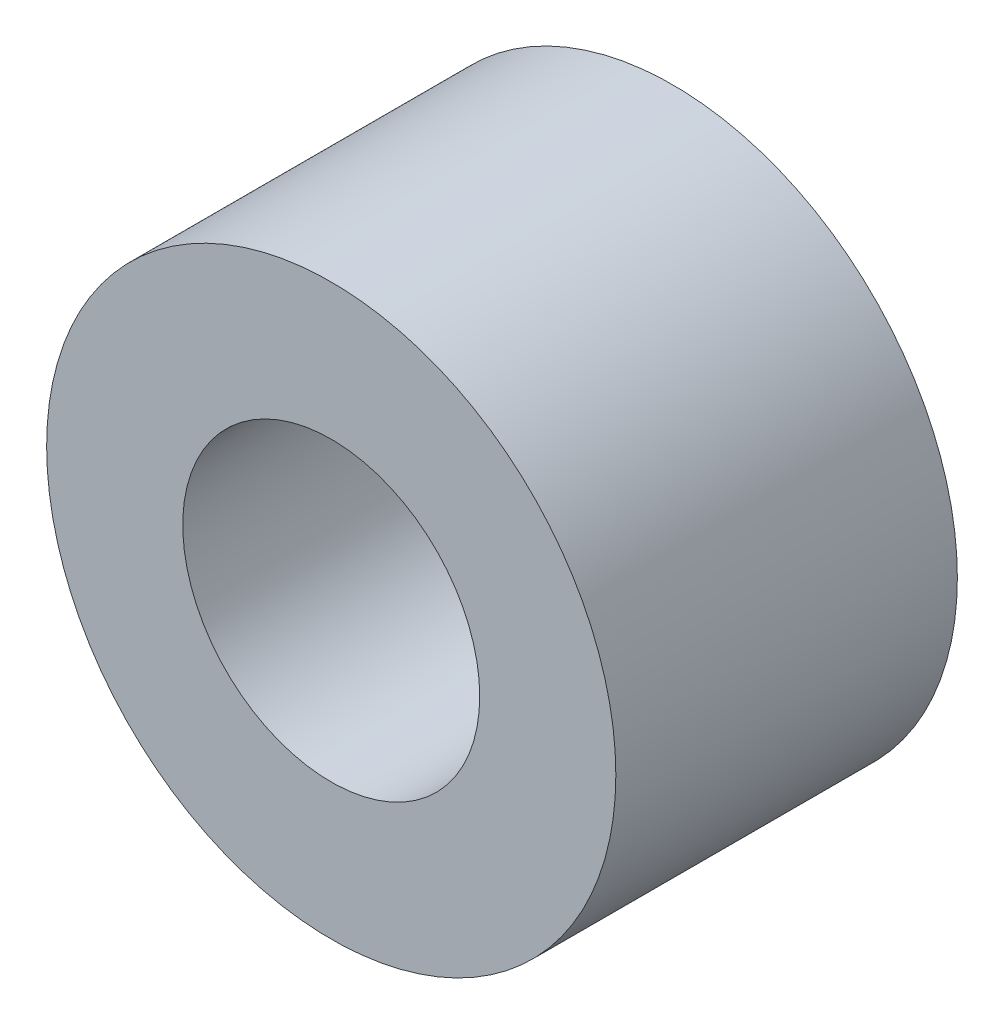
ISO-10303-21;
HEADER;
FILE_DESCRIPTION(('STEP AP214'),'2;1');
FILE_NAME('part.step','',(''),(''),'','','');
FILE_SCHEMA(('AUTOMOTIVE_DESIGN { 1 0 10303 214 1 1 1 1 }'));
ENDSEC;
DATA;
#1=APPLICATION_CONTEXT('core data for automotive mechanical design processes');
#2=APPLICATION_PROTOCOL_DEFINITION('international standard','automotive_design',2000,#1);
#3=PRODUCT_CONTEXT('',#1,'mechanical');
#4=PRODUCT('Part','Part','',(#3));
#5=PRODUCT_RELATED_PRODUCT_CATEGORY('part','',(#4));
#6=PRODUCT_DEFINITION_FORMATION('','',#4);
#7=PRODUCT_DEFINITION_CONTEXT('part definition',#1,'design');
#8=PRODUCT_DEFINITION('design','',#6,#7);
#9=PRODUCT_DEFINITION_SHAPE('','',#8);
#10=(LENGTH_UNIT() NAMED_UNIT(*) SI_UNIT(.MILLI.,.METRE.));
#11=(NAMED_UNIT(*) PLANE_ANGLE_UNIT() SI_UNIT($,.RADIAN.));
#12=(NAMED_UNIT(*) SI_UNIT($,.STERADIAN.) SOLID_ANGLE_UNIT());
#13=UNCERTAINTY_MEASURE_WITH_UNIT(LENGTH_MEASURE(1.E-05),#10,'distance_accuracy_value','');
#14=(GEOMETRIC_REPRESENTATION_CONTEXT(3) GLOBAL_UNCERTAINTY_ASSIGNED_CONTEXT((#13)) GLOBAL_UNIT_ASSIGNED_CONTEXT((#10,
#11,#12)) REPRESENTATION_CONTEXT('',''));
#15=CARTESIAN_POINT('',(0.,0.,0.));
#16=DIRECTION('',(0.,0.,1.));
#17=DIRECTION('',(1.,0.,0.));
#18=AXIS2_PLACEMENT_3D('',#15,#16,#17);
#19=CARTESIAN_POINT('',(0.,0.,13.8));
#20=DIRECTION('',(0.,0.,1.));
#21=DIRECTION('',(1.,0.,0.));
#22=AXIS2_PLACEMENT_3D('',#19,#20,#21);
#23=PLANE('',#22);
#24=CARTESIAN_POINT('',(0.,0.,13.8));
#25=DIRECTION('',(0.,0.,1.));
#26=DIRECTION('',(1.,0.,0.));
#27=AXIS2_PLACEMENT_3D('',#24,#25,#26);
#28=CIRCLE('',#27,11.5);
#29=CARTESIAN_POINT('',(11.5,0.,13.8));
#30=VERTEX_POINT('',#29);
#31=EDGE_CURVE('E10',#30,#30,#28,.T.);
#32=ORIENTED_EDGE('',*,*,#31,.T.);
#33=EDGE_LOOP('',(#32));
#34=FACE_BOUND('',#33,.T.);
#35=CARTESIAN_POINT('',(0.,0.,13.8));
#36=DIRECTION('',(0.,0.,1.));
#37=DIRECTION('',(1.,0.,0.));
#38=AXIS2_PLACEMENT_3D('',#35,#36,#37);
#39=CIRCLE('',#38,6.);
#40=CARTESIAN_POINT('',(6.,0.,13.8));
#41=VERTEX_POINT('',#40);
#42=EDGE_CURVE('E42',#41,#41,#39,.T.);
#43=ORIENTED_EDGE('',*,*,#42,.F.);
#44=EDGE_LOOP('',(#43));
#45=FACE_BOUND('',#44,.T.);
#46=ADVANCED_FACE('F31',(#34,#45),#23,.T.);
#47=CARTESIAN_POINT('',(0.,0.,0.));
#48=DIRECTION('',(0.,0.,1.));
#49=DIRECTION('',(1.,0.,0.));
#50=AXIS2_PLACEMENT_3D('',#47,#48,#49);
#51=PLANE('',#50);
#52=CARTESIAN_POINT('',(0.,0.,0.));
#53=DIRECTION('',(0.,0.,1.));
#54=DIRECTION('',(1.,0.,0.));
#55=AXIS2_PLACEMENT_3D('',#52,#53,#54);
#56=CIRCLE('',#55,11.5);
#57=CARTESIAN_POINT('',(11.5,0.,0.));
#58=VERTEX_POINT('',#57);
#59=EDGE_CURVE('E35',#58,#58,#56,.T.);
#60=ORIENTED_EDGE('',*,*,#59,.F.);
#61=EDGE_LOOP('',(#60));
#62=FACE_BOUND('',#61,.T.);
#63=CARTESIAN_POINT('',(0.,0.,0.));
#64=DIRECTION('',(0.,0.,1.));
#65=DIRECTION('',(1.,0.,0.));
#66=AXIS2_PLACEMENT_3D('',#63,#64,#65);
#67=CIRCLE('',#66,6.);
#68=CARTESIAN_POINT('',(6.,0.,0.));
#69=VERTEX_POINT('',#68);
#70=EDGE_CURVE('E44',#69,#69,#67,.T.);
#71=ORIENTED_EDGE('',*,*,#70,.T.);
#72=EDGE_LOOP('',(#71));
#73=FACE_BOUND('',#72,.T.);
#74=ADVANCED_FACE('F54',(#62,#73),#51,.F.);
#75=CARTESIAN_POINT('',(0.,0.,13.8));
#76=DIRECTION('',(0.,0.,-1.));
#77=DIRECTION('',(-1.,0.,0.));
#78=AXIS2_PLACEMENT_3D('',#75,#76,#77);
#79=CYLINDRICAL_SURFACE('',#78,11.5);
#80=ORIENTED_EDGE('',*,*,#31,.F.);
#81=EDGE_LOOP('',(#80));
#82=FACE_BOUND('',#81,.T.);
#83=ORIENTED_EDGE('',*,*,#59,.T.);
#84=EDGE_LOOP('',(#83));
#85=FACE_BOUND('',#84,.T.);
#86=ADVANCED_FACE('F33',(#82,#85),#79,.T.);
#87=CARTESIAN_POINT('',(0.,0.,13.8));
#88=DIRECTION('',(0.,0.,-1.));
#89=DIRECTION('',(-1.,0.,0.));
#90=AXIS2_PLACEMENT_3D('',#87,#88,#89);
#91=CYLINDRICAL_SURFACE('',#90,6.);
#92=ORIENTED_EDGE('',*,*,#42,.T.);
#93=EDGE_LOOP('',(#92));
#94=FACE_BOUND('',#93,.T.);
#95=ORIENTED_EDGE('',*,*,#70,.F.);
#96=EDGE_LOOP('',(#95));
#97=FACE_BOUND('',#96,.T.);
#98=ADVANCED_FACE('F50',(#94,#97),#91,.F.);
#99=CLOSED_SHELL('',(#46,#74,#86,#98));
#100=MANIFOLD_SOLID_BREP('B2',#99);
#101=ADVANCED_BREP_SHAPE_REPRESENTATION('',(#18,#100),#14);
#102=SHAPE_DEFINITION_REPRESENTATION(#9,#101);
ENDSEC;
END-ISO-10303-21;
